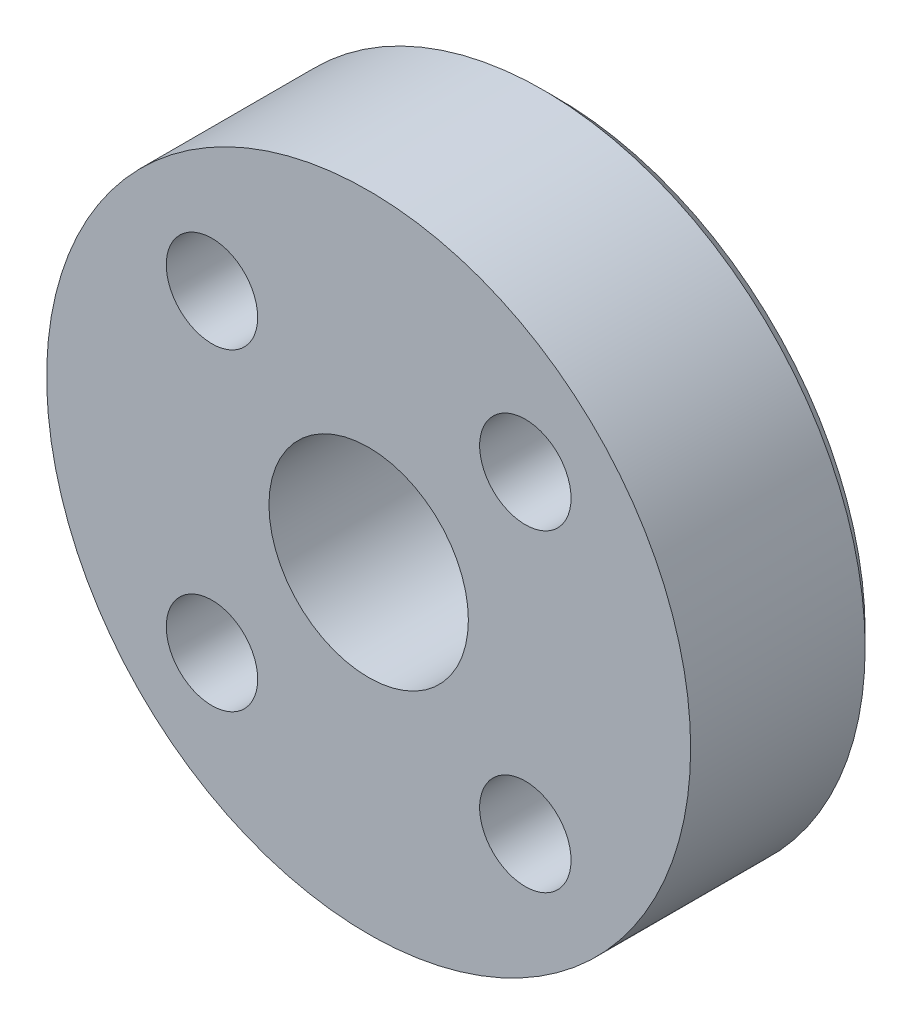
ISO-10303-21;
HEADER;
FILE_DESCRIPTION(('STEP AP214'),'2;1');
FILE_NAME('part.step','',(''),(''),'','','');
FILE_SCHEMA(('AUTOMOTIVE_DESIGN { 1 0 10303 214 1 1 1 1 }'));
ENDSEC;
DATA;
#1=APPLICATION_CONTEXT('core data for automotive mechanical design processes');
#2=APPLICATION_PROTOCOL_DEFINITION('international standard','automotive_design',2000,#1);
#3=PRODUCT_CONTEXT('',#1,'mechanical');
#4=PRODUCT('Part','Part','',(#3));
#5=PRODUCT_RELATED_PRODUCT_CATEGORY('part','',(#4));
#6=PRODUCT_DEFINITION_FORMATION('','',#4);
#7=PRODUCT_DEFINITION_CONTEXT('part definition',#1,'design');
#8=PRODUCT_DEFINITION('design','',#6,#7);
#9=PRODUCT_DEFINITION_SHAPE('','',#8);
#10=(LENGTH_UNIT() NAMED_UNIT(*) SI_UNIT(.MILLI.,.METRE.));
#11=(NAMED_UNIT(*) PLANE_ANGLE_UNIT() SI_UNIT($,.RADIAN.));
#12=(NAMED_UNIT(*) SI_UNIT($,.STERADIAN.) SOLID_ANGLE_UNIT());
#13=UNCERTAINTY_MEASURE_WITH_UNIT(LENGTH_MEASURE(1.E-05),#10,'distance_accuracy_value','');
#14=(GEOMETRIC_REPRESENTATION_CONTEXT(3) GLOBAL_UNCERTAINTY_ASSIGNED_CONTEXT((#13)) GLOBAL_UNIT_ASSIGNED_CONTEXT((#10,
#11,#12)) REPRESENTATION_CONTEXT('',''));
#15=CARTESIAN_POINT('',(0.,0.,0.));
#16=DIRECTION('',(0.,0.,1.));
#17=DIRECTION('',(1.,0.,0.));
#18=AXIS2_PLACEMENT_3D('',#15,#16,#17);
#19=CARTESIAN_POINT('',(0.,16.,-6.19999999999998));
#20=DIRECTION('',(0.,0.,-1.));
#21=DIRECTION('',(1.,0.,0.));
#22=AXIS2_PLACEMENT_3D('',#19,#20,#21);
#23=CYLINDRICAL_SURFACE('',#22,11.625);
#24=CARTESIAN_POINT('',(0.,16.,-12.5));
#25=DIRECTION('',(0.,0.,-1.));
#26=DIRECTION('',(1.,0.,0.));
#27=AXIS2_PLACEMENT_3D('',#24,#25,#26);
#28=CIRCLE('',#27,11.625);
#29=CARTESIAN_POINT('',(11.625,16.,-12.5));
#30=VERTEX_POINT('',#29);
#31=EDGE_CURVE('E25',#30,#30,#28,.F.);
#32=ORIENTED_EDGE('',*,*,#31,.T.);
#33=EDGE_LOOP('',(#32));
#34=FACE_BOUND('',#33,.T.);
#35=CARTESIAN_POINT('',(0.,16.,-6.19999999999998));
#36=DIRECTION('',(0.,0.,-1.));
#37=DIRECTION('',(1.,0.,0.));
#38=AXIS2_PLACEMENT_3D('',#35,#36,#37);
#39=CIRCLE('',#38,11.625);
#40=CARTESIAN_POINT('',(11.625,16.,-6.19999999999998));
#41=VERTEX_POINT('',#40);
#42=EDGE_CURVE('E34',#41,#41,#39,.T.);
#43=ORIENTED_EDGE('',*,*,#42,.T.);
#44=EDGE_LOOP('',(#43));
#45=FACE_BOUND('',#44,.T.);
#46=ADVANCED_FACE('F14',(#34,#45),#23,.T.);
#47=CARTESIAN_POINT('',(0.,16.,-6.19999999999998));
#48=DIRECTION('',(0.,0.,-1.));
#49=DIRECTION('',(1.,0.,0.));
#50=AXIS2_PLACEMENT_3D('',#47,#48,#49);
#51=PLANE('',#50);
#52=CARTESIAN_POINT('',(-5.65685424949235,10.3431457505076,-6.19999999999998));
#53=DIRECTION('',(0.,0.,-1.));
#54=DIRECTION('',(1.,0.,0.));
#55=AXIS2_PLACEMENT_3D('',#52,#53,#54);
#56=CIRCLE('',#55,1.65);
#57=CARTESIAN_POINT('',(-4.00685424949235,10.3431457505076,-6.19999999999998));
#58=VERTEX_POINT('',#57);
#59=EDGE_CURVE('E58',#58,#58,#56,.T.);
#60=ORIENTED_EDGE('',*,*,#59,.T.);
#61=EDGE_LOOP('',(#60));
#62=FACE_BOUND('',#61,.T.);
#63=CARTESIAN_POINT('',(-5.65685424949235,21.6568542494924,-6.19999999999998));
#64=DIRECTION('',(0.,0.,-1.));
#65=DIRECTION('',(1.,0.,0.));
#66=AXIS2_PLACEMENT_3D('',#63,#64,#65);
#67=CIRCLE('',#66,1.65);
#68=CARTESIAN_POINT('',(-4.00685424949235,21.6568542494924,-6.19999999999998));
#69=VERTEX_POINT('',#68);
#70=EDGE_CURVE('E52',#69,#69,#67,.T.);
#71=ORIENTED_EDGE('',*,*,#70,.T.);
#72=EDGE_LOOP('',(#71));
#73=FACE_BOUND('',#72,.T.);
#74=CARTESIAN_POINT('',(5.65685424949235,10.3431457505076,-6.19999999999998));
#75=DIRECTION('',(0.,0.,-1.));
#76=DIRECTION('',(1.,0.,0.));
#77=AXIS2_PLACEMENT_3D('',#74,#75,#76);
#78=CIRCLE('',#77,1.65);
#79=CARTESIAN_POINT('',(7.30685424949235,10.3431457505076,-6.19999999999998));
#80=VERTEX_POINT('',#79);
#81=EDGE_CURVE('E46',#80,#80,#78,.T.);
#82=ORIENTED_EDGE('',*,*,#81,.T.);
#83=EDGE_LOOP('',(#82));
#84=FACE_BOUND('',#83,.T.);
#85=CARTESIAN_POINT('',(5.65685424949243,21.6568542494923,-6.19999999999998));
#86=DIRECTION('',(0.,0.,-1.));
#87=DIRECTION('',(1.,0.,0.));
#88=AXIS2_PLACEMENT_3D('',#85,#86,#87);
#89=CIRCLE('',#88,1.65);
#90=CARTESIAN_POINT('',(7.30685424949243,21.6568542494923,-6.19999999999998));
#91=VERTEX_POINT('',#90);
#92=EDGE_CURVE('E40',#91,#91,#89,.T.);
#93=ORIENTED_EDGE('',*,*,#92,.T.);
#94=EDGE_LOOP('',(#93));
#95=FACE_BOUND('',#94,.T.);
#96=CARTESIAN_POINT('',(0.,16.,-6.19999999999998));
#97=DIRECTION('',(0.,0.,-1.));
#98=DIRECTION('',(1.,0.,0.));
#99=AXIS2_PLACEMENT_3D('',#96,#97,#98);
#100=CIRCLE('',#99,3.6);
#101=CARTESIAN_POINT('',(3.6,16.,-6.19999999999998));
#102=VERTEX_POINT('',#101);
#103=EDGE_CURVE('E37',#102,#102,#100,.T.);
#104=ORIENTED_EDGE('',*,*,#103,.T.);
#105=EDGE_LOOP('',(#104));
#106=FACE_BOUND('',#105,.T.);
#107=ORIENTED_EDGE('',*,*,#42,.F.);
#108=EDGE_LOOP('',(#107));
#109=FACE_BOUND('',#108,.T.);
#110=ADVANCED_FACE('F71',(#62,#73,#84,#95,#106,#109),#51,.F.);
#111=CARTESIAN_POINT('',(0.,16.,-13.));
#112=DIRECTION('',(0.,0.,-1.));
#113=DIRECTION('',(1.,0.,0.));
#114=AXIS2_PLACEMENT_3D('',#111,#112,#113);
#115=PLANE('',#114);
#116=CARTESIAN_POINT('',(-5.65685424949235,10.3431457505076,-13.));
#117=DIRECTION('',(0.,0.,-1.));
#118=DIRECTION('',(1.,0.,0.));
#119=AXIS2_PLACEMENT_3D('',#116,#117,#118);
#120=CIRCLE('',#119,1.64999999999999);
#121=CARTESIAN_POINT('',(-4.00685424949236,10.3431457505076,-13.));
#122=VERTEX_POINT('',#121);
#123=EDGE_CURVE('E61',#122,#122,#120,.T.);
#124=ORIENTED_EDGE('',*,*,#123,.F.);
#125=EDGE_LOOP('',(#124));
#126=FACE_BOUND('',#125,.T.);
#127=CARTESIAN_POINT('',(-5.65685424949235,21.6568542494924,-13.));
#128=DIRECTION('',(0.,0.,-1.));
#129=DIRECTION('',(1.,0.,0.));
#130=AXIS2_PLACEMENT_3D('',#127,#128,#129);
#131=CIRCLE('',#130,1.64999999999999);
#132=CARTESIAN_POINT('',(-4.00685424949236,21.6568542494924,-13.));
#133=VERTEX_POINT('',#132);
#134=EDGE_CURVE('E55',#133,#133,#131,.T.);
#135=ORIENTED_EDGE('',*,*,#134,.F.);
#136=EDGE_LOOP('',(#135));
#137=FACE_BOUND('',#136,.T.);
#138=CARTESIAN_POINT('',(5.65685424949235,10.3431457505076,-13.));
#139=DIRECTION('',(0.,0.,-1.));
#140=DIRECTION('',(1.,0.,0.));
#141=AXIS2_PLACEMENT_3D('',#138,#139,#140);
#142=CIRCLE('',#141,1.64999999999999);
#143=CARTESIAN_POINT('',(7.30685424949234,10.3431457505076,-13.));
#144=VERTEX_POINT('',#143);
#145=EDGE_CURVE('E49',#144,#144,#142,.T.);
#146=ORIENTED_EDGE('',*,*,#145,.F.);
#147=EDGE_LOOP('',(#146));
#148=FACE_BOUND('',#147,.T.);
#149=CARTESIAN_POINT('',(5.65685424949243,21.6568542494923,-13.));
#150=DIRECTION('',(0.,0.,-1.));
#151=DIRECTION('',(1.,0.,0.));
#152=AXIS2_PLACEMENT_3D('',#149,#150,#151);
#153=CIRCLE('',#152,1.64999999999999);
#154=CARTESIAN_POINT('',(7.30685424949242,21.6568542494923,-13.));
#155=VERTEX_POINT('',#154);
#156=EDGE_CURVE('E43',#155,#155,#153,.T.);
#157=ORIENTED_EDGE('',*,*,#156,.F.);
#158=EDGE_LOOP('',(#157));
#159=FACE_BOUND('',#158,.T.);
#160=CARTESIAN_POINT('',(0.,16.,-13.));
#161=DIRECTION('',(0.,0.,-1.));
#162=DIRECTION('',(1.,0.,0.));
#163=AXIS2_PLACEMENT_3D('',#160,#161,#162);
#164=CIRCLE('',#163,4.59999999999999);
#165=CARTESIAN_POINT('',(4.59999999999999,16.,-13.));
#166=VERTEX_POINT('',#165);
#167=EDGE_CURVE('E10',#166,#166,#164,.F.);
#168=ORIENTED_EDGE('',*,*,#167,.T.);
#169=EDGE_LOOP('',(#168));
#170=FACE_BOUND('',#169,.T.);
#171=CARTESIAN_POINT('',(0.,16.,-13.));
#172=DIRECTION('',(0.,0.,-1.));
#173=DIRECTION('',(1.,0.,0.));
#174=AXIS2_PLACEMENT_3D('',#171,#172,#173);
#175=CIRCLE('',#174,11.125);
#176=CARTESIAN_POINT('',(11.125,16.,-13.));
#177=VERTEX_POINT('',#176);
#178=EDGE_CURVE('E29',#177,#177,#175,.T.);
#179=ORIENTED_EDGE('',*,*,#178,.T.);
#180=EDGE_LOOP('',(#179));
#181=FACE_BOUND('',#180,.T.);
#182=ADVANCED_FACE('F67',(#126,#137,#148,#159,#170,#181),#115,.T.);
#183=CARTESIAN_POINT('',(0.,16.,-6.19999999999998));
#184=DIRECTION('',(0.,0.,-1.));
#185=DIRECTION('',(1.,0.,0.));
#186=AXIS2_PLACEMENT_3D('',#183,#184,#185);
#187=CYLINDRICAL_SURFACE('',#186,3.6);
#188=CARTESIAN_POINT('',(0.,16.,-12.));
#189=DIRECTION('',(0.,0.,-1.));
#190=DIRECTION('',(1.,0.,0.));
#191=AXIS2_PLACEMENT_3D('',#188,#189,#190);
#192=CIRCLE('',#191,3.6);
#193=CARTESIAN_POINT('',(3.6,16.,-12.));
#194=VERTEX_POINT('',#193);
#195=EDGE_CURVE('E21',#194,#194,#192,.T.);
#196=ORIENTED_EDGE('',*,*,#195,.T.);
#197=EDGE_LOOP('',(#196));
#198=FACE_BOUND('',#197,.T.);
#199=ORIENTED_EDGE('',*,*,#103,.F.);
#200=EDGE_LOOP('',(#199));
#201=FACE_BOUND('',#200,.T.);
#202=ADVANCED_FACE('F70',(#198,#201),#187,.F.);
#203=CARTESIAN_POINT('',(0.,16.,-13.));
#204=DIRECTION('',(0.,0.,1.));
#205=DIRECTION('',(-1.,0.,0.));
#206=AXIS2_PLACEMENT_3D('',#203,#204,#205);
#207=CONICAL_SURFACE('',#206,11.125,0.78539816339744);
#208=ORIENTED_EDGE('',*,*,#31,.F.);
#209=EDGE_LOOP('',(#208));
#210=FACE_BOUND('',#209,.T.);
#211=ORIENTED_EDGE('',*,*,#178,.F.);
#212=EDGE_LOOP('',(#211));
#213=FACE_BOUND('',#212,.T.);
#214=ADVANCED_FACE('F81',(#210,#213),#207,.T.);
#215=CARTESIAN_POINT('',(0.,16.,-12.));
#216=DIRECTION('',(0.,0.,-1.));
#217=DIRECTION('',(1.,0.,0.));
#218=AXIS2_PLACEMENT_3D('',#215,#216,#217);
#219=CONICAL_SURFACE('',#218,3.6,0.78539816339745);
#220=ORIENTED_EDGE('',*,*,#167,.F.);
#221=EDGE_LOOP('',(#220));
#222=FACE_BOUND('',#221,.T.);
#223=ORIENTED_EDGE('',*,*,#195,.F.);
#224=EDGE_LOOP('',(#223));
#225=FACE_BOUND('',#224,.T.);
#226=ADVANCED_FACE('F16',(#222,#225),#219,.F.);
#227=CARTESIAN_POINT('',(5.65685424949243,21.6568542494923,-13.));
#228=DIRECTION('',(0.,0.,-1.));
#229=DIRECTION('',(1.,0.,0.));
#230=AXIS2_PLACEMENT_3D('',#227,#228,#229);
#231=CYLINDRICAL_SURFACE('',#230,1.65);
#232=ORIENTED_EDGE('',*,*,#92,.F.);
#233=EDGE_LOOP('',(#232));
#234=FACE_BOUND('',#233,.T.);
#235=ORIENTED_EDGE('',*,*,#156,.T.);
#236=EDGE_LOOP('',(#235));
#237=FACE_BOUND('',#236,.T.);
#238=ADVANCED_FACE('F89',(#234,#237),#231,.F.);
#239=CARTESIAN_POINT('',(5.65685424949235,10.3431457505076,-13.));
#240=DIRECTION('',(0.,0.,-1.));
#241=DIRECTION('',(1.,0.,0.));
#242=AXIS2_PLACEMENT_3D('',#239,#240,#241);
#243=CYLINDRICAL_SURFACE('',#242,1.64999999999999);
#244=ORIENTED_EDGE('',*,*,#81,.F.);
#245=EDGE_LOOP('',(#244));
#246=FACE_BOUND('',#245,.T.);
#247=ORIENTED_EDGE('',*,*,#145,.T.);
#248=EDGE_LOOP('',(#247));
#249=FACE_BOUND('',#248,.T.);
#250=ADVANCED_FACE('F105',(#246,#249),#243,.F.);
#251=CARTESIAN_POINT('',(-5.65685424949235,21.6568542494924,-13.));
#252=DIRECTION('',(0.,0.,-1.));
#253=DIRECTION('',(1.,0.,0.));
#254=AXIS2_PLACEMENT_3D('',#251,#252,#253);
#255=CYLINDRICAL_SURFACE('',#254,1.64999999999999);
#256=ORIENTED_EDGE('',*,*,#70,.F.);
#257=EDGE_LOOP('',(#256));
#258=FACE_BOUND('',#257,.T.);
#259=ORIENTED_EDGE('',*,*,#134,.T.);
#260=EDGE_LOOP('',(#259));
#261=FACE_BOUND('',#260,.T.);
#262=ADVANCED_FACE('F109',(#258,#261),#255,.F.);
#263=CARTESIAN_POINT('',(-5.65685424949235,10.3431457505076,-13.));
#264=DIRECTION('',(0.,0.,-1.));
#265=DIRECTION('',(1.,0.,0.));
#266=AXIS2_PLACEMENT_3D('',#263,#264,#265);
#267=CYLINDRICAL_SURFACE('',#266,1.64999999999999);
#268=ORIENTED_EDGE('',*,*,#59,.F.);
#269=EDGE_LOOP('',(#268));
#270=FACE_BOUND('',#269,.T.);
#271=ORIENTED_EDGE('',*,*,#123,.T.);
#272=EDGE_LOOP('',(#271));
#273=FACE_BOUND('',#272,.T.);
#274=ADVANCED_FACE('F65',(#270,#273),#267,.F.);
#275=CLOSED_SHELL('',(#46,#110,#182,#202,#214,#226,#238,#250,#262,#274));
#276=MANIFOLD_SOLID_BREP('B1',#275);
#277=ADVANCED_BREP_SHAPE_REPRESENTATION('',(#18,#276),#14);
#278=SHAPE_DEFINITION_REPRESENTATION(#9,#277);
ENDSEC;
END-ISO-10303-21;
